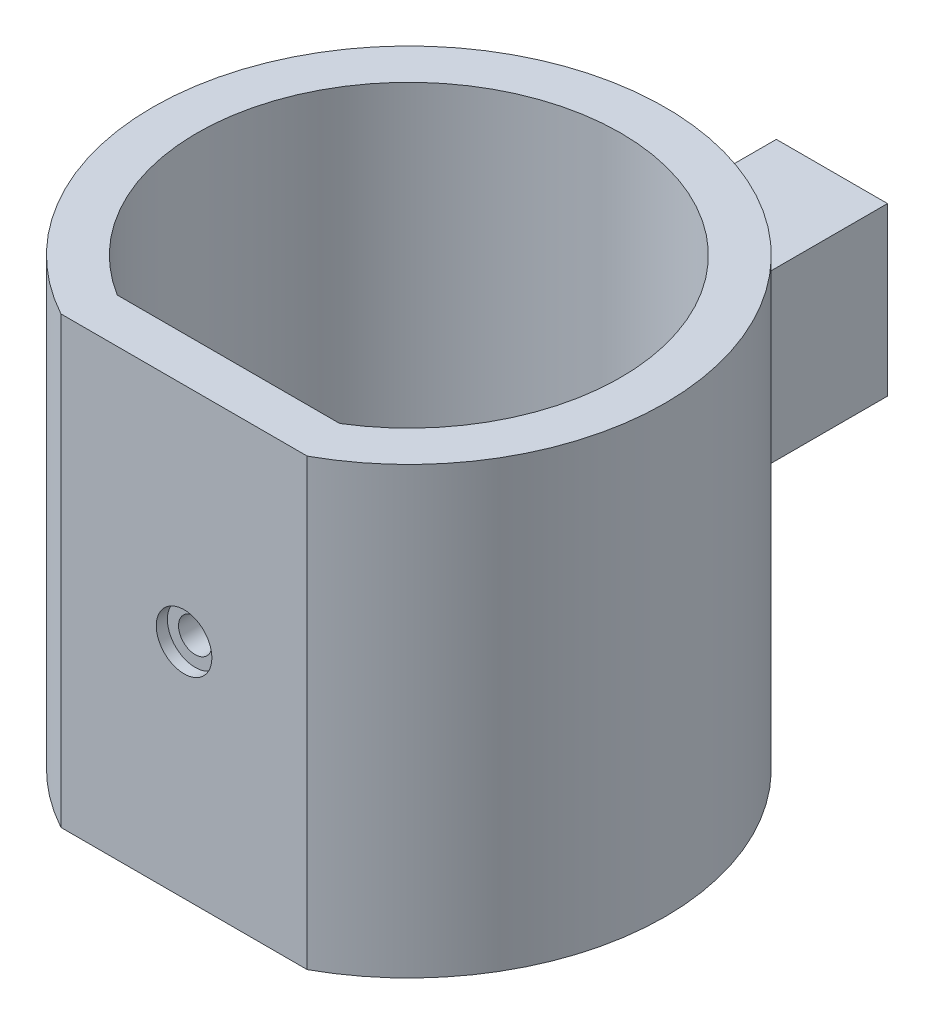
ISO-10303-21;
HEADER;
FILE_DESCRIPTION(('STEP AP214'),'2;1');
FILE_NAME('part.step','',(''),(''),'','','');
FILE_SCHEMA(('AUTOMOTIVE_DESIGN { 1 0 10303 214 1 1 1 1 }'));
ENDSEC;
DATA;
#1=APPLICATION_CONTEXT('core data for automotive mechanical design processes');
#2=APPLICATION_PROTOCOL_DEFINITION('international standard','automotive_design',2000,#1);
#3=PRODUCT_CONTEXT('',#1,'mechanical');
#4=PRODUCT('Part','Part','',(#3));
#5=PRODUCT_RELATED_PRODUCT_CATEGORY('part','',(#4));
#6=PRODUCT_DEFINITION_FORMATION('','',#4);
#7=PRODUCT_DEFINITION_CONTEXT('part definition',#1,'design');
#8=PRODUCT_DEFINITION('design','',#6,#7);
#9=PRODUCT_DEFINITION_SHAPE('','',#8);
#10=(LENGTH_UNIT() NAMED_UNIT(*) SI_UNIT(.MILLI.,.METRE.));
#11=(NAMED_UNIT(*) PLANE_ANGLE_UNIT() SI_UNIT($,.RADIAN.));
#12=(NAMED_UNIT(*) SI_UNIT($,.STERADIAN.) SOLID_ANGLE_UNIT());
#13=UNCERTAINTY_MEASURE_WITH_UNIT(LENGTH_MEASURE(1.E-05),#10,'distance_accuracy_value','');
#14=(GEOMETRIC_REPRESENTATION_CONTEXT(3) GLOBAL_UNCERTAINTY_ASSIGNED_CONTEXT((#13)) GLOBAL_UNIT_ASSIGNED_CONTEXT((#10,
#11,#12)) REPRESENTATION_CONTEXT('',''));
#15=CARTESIAN_POINT('',(0.,0.,0.));
#16=DIRECTION('',(0.,0.,1.));
#17=DIRECTION('',(1.,0.,0.));
#18=AXIS2_PLACEMENT_3D('',#15,#16,#17);
#19=CARTESIAN_POINT('',(0.,0.,-38.05));
#20=DIRECTION('',(0.,0.,-1.));
#21=DIRECTION('',(-1.,0.,0.));
#22=AXIS2_PLACEMENT_3D('',#19,#20,#21);
#23=PLANE('',#22);
#24=DIRECTION('',(0.,1.,0.));
#25=VECTOR('',#24,1.);
#26=CARTESIAN_POINT('',(-5.,-7.5,-38.05));
#27=LINE('',#26,#25);
#28=CARTESIAN_POINT('',(-5.,-7.5,-38.05));
#29=VERTEX_POINT('',#28);
#30=CARTESIAN_POINT('',(-5.,7.5,-38.05));
#31=VERTEX_POINT('',#30);
#32=EDGE_CURVE('E125',#29,#31,#27,.T.);
#33=ORIENTED_EDGE('',*,*,#32,.T.);
#34=DIRECTION('',(1.,0.,0.));
#35=VECTOR('',#34,1.);
#36=CARTESIAN_POINT('',(5.,7.5,-38.05));
#37=LINE('',#36,#35);
#38=CARTESIAN_POINT('',(5.,7.5,-38.05));
#39=VERTEX_POINT('',#38);
#40=EDGE_CURVE('E132',#31,#39,#37,.T.);
#41=ORIENTED_EDGE('',*,*,#40,.T.);
#42=DIRECTION('',(0.,-1.,0.));
#43=VECTOR('',#42,1.);
#44=CARTESIAN_POINT('',(5.,-7.5,-38.05));
#45=LINE('',#44,#43);
#46=CARTESIAN_POINT('',(5.,-7.5,-38.05));
#47=VERTEX_POINT('',#46);
#48=EDGE_CURVE('E131',#39,#47,#45,.T.);
#49=ORIENTED_EDGE('',*,*,#48,.T.);
#50=DIRECTION('',(-1.,0.,0.));
#51=VECTOR('',#50,1.);
#52=CARTESIAN_POINT('',(5.,-7.5,-38.05));
#53=LINE('',#52,#51);
#54=EDGE_CURVE('E116',#47,#29,#53,.T.);
#55=ORIENTED_EDGE('',*,*,#54,.T.);
#56=EDGE_LOOP('',(#33,#41,#49,#55));
#57=FACE_BOUND('',#56,.T.);
#58=ADVANCED_FACE('F37',(#57),#23,.T.);
#59=CARTESIAN_POINT('',(5.,-7.5,-153.05));
#60=DIRECTION('',(-1.,0.,0.));
#61=DIRECTION('',(0.,0.,1.));
#62=AXIS2_PLACEMENT_3D('',#59,#60,#61);
#63=PLANE('',#62);
#64=ORIENTED_EDGE('',*,*,#48,.F.);
#65=DIRECTION('',(0.,0.,1.));
#66=VECTOR('',#65,1.);
#67=CARTESIAN_POINT('',(5.,7.5,-153.05));
#68=LINE('',#67,#66);
#69=CARTESIAN_POINT('',(5.,7.5,-25.5088710059853));
#70=VERTEX_POINT('',#69);
#71=EDGE_CURVE('E140',#39,#70,#68,.T.);
#72=ORIENTED_EDGE('',*,*,#71,.T.);
#73=DIRECTION('',(0.,1.,0.));
#74=VECTOR('',#73,1.);
#75=CARTESIAN_POINT('',(5.,-7.5,-25.5088710059853));
#76=LINE('',#75,#74);
#77=CARTESIAN_POINT('',(5.,-7.5,-25.5088710059853));
#78=VERTEX_POINT('',#77);
#79=EDGE_CURVE('E152',#70,#78,#76,.F.);
#80=ORIENTED_EDGE('',*,*,#79,.T.);
#81=DIRECTION('',(0.,0.,1.));
#82=VECTOR('',#81,1.);
#83=CARTESIAN_POINT('',(5.,-7.5,-153.05));
#84=LINE('',#83,#82);
#85=EDGE_CURVE('E123',#47,#78,#84,.T.);
#86=ORIENTED_EDGE('',*,*,#85,.F.);
#87=EDGE_LOOP('',(#64,#72,#80,#86));
#88=FACE_BOUND('',#87,.T.);
#89=ADVANCED_FACE('F157',(#88),#63,.F.);
#90=CARTESIAN_POINT('',(-5.,-7.5,-153.05));
#91=DIRECTION('',(1.,0.,0.));
#92=DIRECTION('',(0.,0.,-1.));
#93=AXIS2_PLACEMENT_3D('',#90,#91,#92);
#94=PLANE('',#93);
#95=ORIENTED_EDGE('',*,*,#32,.F.);
#96=DIRECTION('',(0.,0.,1.));
#97=VECTOR('',#96,1.);
#98=CARTESIAN_POINT('',(-5.,-7.5,-153.05));
#99=LINE('',#98,#97);
#100=CARTESIAN_POINT('',(-5.,-7.5,-25.5088710059853));
#101=VERTEX_POINT('',#100);
#102=EDGE_CURVE('E41',#29,#101,#99,.T.);
#103=ORIENTED_EDGE('',*,*,#102,.T.);
#104=DIRECTION('',(0.,1.,0.));
#105=VECTOR('',#104,1.);
#106=CARTESIAN_POINT('',(-5.,7.5,-25.5088710059853));
#107=LINE('',#106,#105);
#108=CARTESIAN_POINT('',(-5.,7.5,-25.5088710059853));
#109=VERTEX_POINT('',#108);
#110=EDGE_CURVE('E169',#101,#109,#107,.T.);
#111=ORIENTED_EDGE('',*,*,#110,.T.);
#112=DIRECTION('',(0.,0.,1.));
#113=VECTOR('',#112,1.);
#114=CARTESIAN_POINT('',(-5.,7.5,-153.05));
#115=LINE('',#114,#113);
#116=EDGE_CURVE('E127',#31,#109,#115,.T.);
#117=ORIENTED_EDGE('',*,*,#116,.F.);
#118=EDGE_LOOP('',(#95,#103,#111,#117));
#119=FACE_BOUND('',#118,.T.);
#120=ADVANCED_FACE('F126',(#119),#94,.F.);
#121=CARTESIAN_POINT('',(5.,7.5,-153.05));
#122=DIRECTION('',(0.,-1.,0.));
#123=DIRECTION('',(0.,0.,-1.));
#124=AXIS2_PLACEMENT_3D('',#121,#122,#123);
#125=PLANE('',#124);
#126=ORIENTED_EDGE('',*,*,#40,.F.);
#127=ORIENTED_EDGE('',*,*,#116,.T.);
#128=CARTESIAN_POINT('',(-9.,7.5,-25.5088710059853));
#129=DIRECTION('',(0.,-1.,0.));
#130=DIRECTION('',(0.,0.,-1.));
#131=AXIS2_PLACEMENT_3D('',#128,#129,#130);
#132=CIRCLE('',#131,4.);
#133=CARTESIAN_POINT('',(-7.66913123844732,7.5,-21.736764387725));
#134=VERTEX_POINT('',#133);
#135=EDGE_CURVE('E160',#109,#134,#132,.T.);
#136=ORIENTED_EDGE('',*,*,#135,.T.);
#137=CARTESIAN_POINT('',(0.,7.5,0.));
#138=DIRECTION('',(0.,1.,0.));
#139=DIRECTION('',(0.,0.,1.));
#140=AXIS2_PLACEMENT_3D('',#137,#138,#139);
#141=CIRCLE('',#140,23.05);
#142=CARTESIAN_POINT('',(7.66913123844732,7.5,-21.736764387725));
#143=VERTEX_POINT('',#142);
#144=EDGE_CURVE('E122',#134,#143,#141,.F.);
#145=ORIENTED_EDGE('',*,*,#144,.T.);
#146=CARTESIAN_POINT('',(9.,7.5,-25.5088710059853));
#147=DIRECTION('',(0.,-1.,0.));
#148=DIRECTION('',(0.,0.,-1.));
#149=AXIS2_PLACEMENT_3D('',#146,#147,#148);
#150=CIRCLE('',#149,4.);
#151=EDGE_CURVE('E155',#143,#70,#150,.T.);
#152=ORIENTED_EDGE('',*,*,#151,.T.);
#153=ORIENTED_EDGE('',*,*,#71,.F.);
#154=EDGE_LOOP('',(#126,#127,#136,#145,#152,#153));
#155=FACE_BOUND('',#154,.T.);
#156=ADVANCED_FACE('F39',(#155),#125,.F.);
#157=CARTESIAN_POINT('',(5.,-7.5,-153.05));
#158=DIRECTION('',(0.,1.,0.));
#159=DIRECTION('',(0.,0.,1.));
#160=AXIS2_PLACEMENT_3D('',#157,#158,#159);
#161=PLANE('',#160);
#162=ORIENTED_EDGE('',*,*,#54,.F.);
#163=ORIENTED_EDGE('',*,*,#85,.T.);
#164=CARTESIAN_POINT('',(9.,-7.5,-25.5088710059853));
#165=DIRECTION('',(0.,1.,0.));
#166=DIRECTION('',(0.,0.,1.));
#167=AXIS2_PLACEMENT_3D('',#164,#165,#166);
#168=CIRCLE('',#167,4.);
#169=CARTESIAN_POINT('',(7.66913123844732,-7.5,-21.736764387725));
#170=VERTEX_POINT('',#169);
#171=EDGE_CURVE('E144',#78,#170,#168,.T.);
#172=ORIENTED_EDGE('',*,*,#171,.T.);
#173=CARTESIAN_POINT('',(0.,-7.5,0.));
#174=DIRECTION('',(0.,-1.,0.));
#175=DIRECTION('',(0.,0.,-1.));
#176=AXIS2_PLACEMENT_3D('',#173,#174,#175);
#177=CIRCLE('',#176,23.05);
#178=CARTESIAN_POINT('',(-7.66913123844732,-7.5,-21.736764387725));
#179=VERTEX_POINT('',#178);
#180=EDGE_CURVE('E199',#170,#179,#177,.F.);
#181=ORIENTED_EDGE('',*,*,#180,.T.);
#182=CARTESIAN_POINT('',(-9.,-7.5,-25.5088710059853));
#183=DIRECTION('',(0.,1.,0.));
#184=DIRECTION('',(0.,0.,1.));
#185=AXIS2_PLACEMENT_3D('',#182,#183,#184);
#186=CIRCLE('',#185,4.);
#187=EDGE_CURVE('E118',#179,#101,#186,.T.);
#188=ORIENTED_EDGE('',*,*,#187,.T.);
#189=ORIENTED_EDGE('',*,*,#102,.F.);
#190=EDGE_LOOP('',(#162,#163,#172,#181,#188,#189));
#191=FACE_BOUND('',#190,.T.);
#192=ADVANCED_FACE('F114',(#191),#161,.F.);
#193=CARTESIAN_POINT('',(0.,20.,0.));
#194=DIRECTION('',(0.,-1.,0.));
#195=DIRECTION('',(0.,0.,-1.));
#196=AXIS2_PLACEMENT_3D('',#193,#194,#195);
#197=CYLINDRICAL_SURFACE('',#196,23.05);
#198=CARTESIAN_POINT('',(0.,-20.,0.));
#199=DIRECTION('',(0.,1.,0.));
#200=DIRECTION('',(0.,0.,1.));
#201=AXIS2_PLACEMENT_3D('',#198,#199,#200);
#202=CIRCLE('',#201,23.05);
#203=CARTESIAN_POINT('',(11.076364599346,-20.,20.2142684077944));
#204=VERTEX_POINT('',#203);
#205=CARTESIAN_POINT('',(-11.076364599346,-20.,20.2142684077944));
#206=VERTEX_POINT('',#205);
#207=EDGE_CURVE('E180',#204,#206,#202,.T.);
#208=ORIENTED_EDGE('',*,*,#207,.T.);
#209=DIRECTION('',(0.,-1.,0.));
#210=VECTOR('',#209,1.);
#211=CARTESIAN_POINT('',(-11.076364599346,20.,20.2142684077944));
#212=LINE('',#211,#210);
#213=CARTESIAN_POINT('',(-11.076364599346,20.,20.2142684077944));
#214=VERTEX_POINT('',#213);
#215=EDGE_CURVE('E171',#214,#206,#212,.T.);
#216=ORIENTED_EDGE('',*,*,#215,.F.);
#217=CARTESIAN_POINT('',(0.,20.,0.));
#218=DIRECTION('',(0.,1.,0.));
#219=DIRECTION('',(0.,0.,1.));
#220=AXIS2_PLACEMENT_3D('',#217,#218,#219);
#221=CIRCLE('',#220,23.05);
#222=CARTESIAN_POINT('',(11.076364599346,20.,20.2142684077944));
#223=VERTEX_POINT('',#222);
#224=EDGE_CURVE('E181',#223,#214,#221,.T.);
#225=ORIENTED_EDGE('',*,*,#224,.F.);
#226=DIRECTION('',(0.,-1.,0.));
#227=VECTOR('',#226,1.);
#228=CARTESIAN_POINT('',(11.076364599346,20.,20.2142684077944));
#229=LINE('',#228,#227);
#230=EDGE_CURVE('E174',#223,#204,#229,.T.);
#231=ORIENTED_EDGE('',*,*,#230,.T.);
#232=EDGE_LOOP('',(#208,#216,#225,#231));
#233=FACE_BOUND('',#232,.T.);
#234=ORIENTED_EDGE('',*,*,#144,.F.);
#235=DIRECTION('',(0.,-1.,0.));
#236=VECTOR('',#235,1.);
#237=CARTESIAN_POINT('',(-7.66913123844732,20.,-21.736764387725));
#238=LINE('',#237,#236);
#239=EDGE_CURVE('E159',#134,#179,#238,.T.);
#240=ORIENTED_EDGE('',*,*,#239,.T.);
#241=ORIENTED_EDGE('',*,*,#180,.F.);
#242=DIRECTION('',(0.,-1.,0.));
#243=VECTOR('',#242,1.);
#244=CARTESIAN_POINT('',(7.66913123844732,20.,-21.736764387725));
#245=LINE('',#244,#243);
#246=EDGE_CURVE('E154',#170,#143,#245,.F.);
#247=ORIENTED_EDGE('',*,*,#246,.T.);
#248=EDGE_LOOP('',(#234,#240,#241,#247));
#249=FACE_BOUND('',#248,.T.);
#250=ADVANCED_FACE('F238',(#233,#249),#197,.T.);
#251=CARTESIAN_POINT('',(0.,20.,0.));
#252=DIRECTION('',(0.,1.,0.));
#253=DIRECTION('',(0.,0.,1.));
#254=AXIS2_PLACEMENT_3D('',#251,#252,#253);
#255=PLANE('',#254);
#256=ORIENTED_EDGE('',*,*,#224,.T.);
#257=DIRECTION('',(1.,0.,0.));
#258=VECTOR('',#257,1.);
#259=CARTESIAN_POINT('',(-11.076364599346,20.,20.2142684077944));
#260=LINE('',#259,#258);
#261=EDGE_CURVE('E177',#214,#223,#260,.T.);
#262=ORIENTED_EDGE('',*,*,#261,.T.);
#263=EDGE_LOOP('',(#256,#262));
#264=FACE_BOUND('',#263,.T.);
#265=DIRECTION('',(1.,0.,0.));
#266=VECTOR('',#265,1.);
#267=CARTESIAN_POINT('',(-10.,20.,16.2142684077944));
#268=LINE('',#267,#266);
#269=CARTESIAN_POINT('',(-10.,20.,16.2142684077944));
#270=VERTEX_POINT('',#269);
#271=CARTESIAN_POINT('',(10.,20.,16.2142684077944));
#272=VERTEX_POINT('',#271);
#273=EDGE_CURVE('E191',#270,#272,#268,.T.);
#274=ORIENTED_EDGE('',*,*,#273,.F.);
#275=CARTESIAN_POINT('',(0.,20.,0.));
#276=DIRECTION('',(0.,1.,0.));
#277=DIRECTION('',(0.,0.,1.));
#278=AXIS2_PLACEMENT_3D('',#275,#276,#277);
#279=CIRCLE('',#278,19.05);
#280=EDGE_CURVE('E193',#272,#270,#279,.T.);
#281=ORIENTED_EDGE('',*,*,#280,.F.);
#282=EDGE_LOOP('',(#274,#281));
#283=FACE_BOUND('',#282,.T.);
#284=ADVANCED_FACE('F244',(#264,#283),#255,.T.);
#285=CARTESIAN_POINT('',(0.,-20.,0.));
#286=DIRECTION('',(0.,1.,0.));
#287=DIRECTION('',(0.,0.,1.));
#288=AXIS2_PLACEMENT_3D('',#285,#286,#287);
#289=PLANE('',#288);
#290=ORIENTED_EDGE('',*,*,#207,.F.);
#291=DIRECTION('',(1.,0.,0.));
#292=VECTOR('',#291,1.);
#293=CARTESIAN_POINT('',(-11.076364599346,-20.,20.2142684077944));
#294=LINE('',#293,#292);
#295=EDGE_CURVE('E178',#206,#204,#294,.T.);
#296=ORIENTED_EDGE('',*,*,#295,.F.);
#297=EDGE_LOOP('',(#290,#296));
#298=FACE_BOUND('',#297,.T.);
#299=CARTESIAN_POINT('',(0.,-20.,0.));
#300=DIRECTION('',(0.,1.,0.));
#301=DIRECTION('',(0.,0.,1.));
#302=AXIS2_PLACEMENT_3D('',#299,#300,#301);
#303=CIRCLE('',#302,19.05);
#304=CARTESIAN_POINT('',(10.,-20.,16.2142684077944));
#305=VERTEX_POINT('',#304);
#306=CARTESIAN_POINT('',(-10.,-20.,16.2142684077944));
#307=VERTEX_POINT('',#306);
#308=EDGE_CURVE('E141',#305,#307,#303,.T.);
#309=ORIENTED_EDGE('',*,*,#308,.T.);
#310=DIRECTION('',(1.,0.,0.));
#311=VECTOR('',#310,1.);
#312=CARTESIAN_POINT('',(-10.,-20.,16.2142684077944));
#313=LINE('',#312,#311);
#314=EDGE_CURVE('E54',#307,#305,#313,.T.);
#315=ORIENTED_EDGE('',*,*,#314,.T.);
#316=EDGE_LOOP('',(#309,#315));
#317=FACE_BOUND('',#316,.T.);
#318=ADVANCED_FACE('F268',(#298,#317),#289,.F.);
#319=CARTESIAN_POINT('',(-11.076364599346,20.,20.2142684077944));
#320=DIRECTION('',(0.,0.,-1.));
#321=DIRECTION('',(-1.,0.,0.));
#322=AXIS2_PLACEMENT_3D('',#319,#320,#321);
#323=PLANE('',#322);
#324=CARTESIAN_POINT('',(0.,0.,20.2142684077944));
#325=DIRECTION('',(0.,0.,1.));
#326=DIRECTION('',(1.,0.,0.));
#327=AXIS2_PLACEMENT_3D('',#324,#325,#326);
#328=CIRCLE('',#327,2.5);
#329=CARTESIAN_POINT('',(2.5,0.,20.2142684077944));
#330=VERTEX_POINT('',#329);
#331=EDGE_CURVE('E11',#330,#330,#328,.T.);
#332=ORIENTED_EDGE('',*,*,#331,.F.);
#333=EDGE_LOOP('',(#332));
#334=FACE_BOUND('',#333,.T.);
#335=ORIENTED_EDGE('',*,*,#295,.T.);
#336=ORIENTED_EDGE('',*,*,#230,.F.);
#337=ORIENTED_EDGE('',*,*,#261,.F.);
#338=ORIENTED_EDGE('',*,*,#215,.T.);
#339=EDGE_LOOP('',(#335,#336,#337,#338));
#340=FACE_BOUND('',#339,.T.);
#341=ADVANCED_FACE('F265',(#334,#340),#323,.F.);
#342=CARTESIAN_POINT('',(0.,20.,0.));
#343=DIRECTION('',(0.,-1.,0.));
#344=DIRECTION('',(0.,0.,-1.));
#345=AXIS2_PLACEMENT_3D('',#342,#343,#344);
#346=CYLINDRICAL_SURFACE('',#345,19.05);
#347=ORIENTED_EDGE('',*,*,#308,.F.);
#348=DIRECTION('',(0.,-1.,0.));
#349=VECTOR('',#348,1.);
#350=CARTESIAN_POINT('',(10.,20.,16.2142684077944));
#351=LINE('',#350,#349);
#352=EDGE_CURVE('E189',#272,#305,#351,.T.);
#353=ORIENTED_EDGE('',*,*,#352,.F.);
#354=ORIENTED_EDGE('',*,*,#280,.T.);
#355=DIRECTION('',(0.,-1.,0.));
#356=VECTOR('',#355,1.);
#357=CARTESIAN_POINT('',(-10.,20.,16.2142684077944));
#358=LINE('',#357,#356);
#359=EDGE_CURVE('E184',#270,#307,#358,.T.);
#360=ORIENTED_EDGE('',*,*,#359,.T.);
#361=EDGE_LOOP('',(#347,#353,#354,#360));
#362=FACE_BOUND('',#361,.T.);
#363=ADVANCED_FACE('F261',(#362),#346,.F.);
#364=CARTESIAN_POINT('',(-10.,20.,16.2142684077944));
#365=DIRECTION('',(0.,0.,-1.));
#366=DIRECTION('',(-1.,0.,0.));
#367=AXIS2_PLACEMENT_3D('',#364,#365,#366);
#368=PLANE('',#367);
#369=CARTESIAN_POINT('',(0.,0.,16.2142684077944));
#370=DIRECTION('',(0.,0.,-1.));
#371=DIRECTION('',(-1.,0.,0.));
#372=AXIS2_PLACEMENT_3D('',#369,#370,#371);
#373=CIRCLE('',#372,1.5);
#374=CARTESIAN_POINT('',(-1.5,0.,16.2142684077944));
#375=VERTEX_POINT('',#374);
#376=EDGE_CURVE('E201',#375,#375,#373,.F.);
#377=ORIENTED_EDGE('',*,*,#376,.T.);
#378=EDGE_LOOP('',(#377));
#379=FACE_BOUND('',#378,.T.);
#380=ORIENTED_EDGE('',*,*,#314,.F.);
#381=ORIENTED_EDGE('',*,*,#359,.F.);
#382=ORIENTED_EDGE('',*,*,#273,.T.);
#383=ORIENTED_EDGE('',*,*,#352,.T.);
#384=EDGE_LOOP('',(#380,#381,#382,#383));
#385=FACE_BOUND('',#384,.T.);
#386=ADVANCED_FACE('F254',(#379,#385),#368,.T.);
#387=CARTESIAN_POINT('',(-9.,20.,-25.5088710059853));
#388=DIRECTION('',(0.,-1.,0.));
#389=DIRECTION('',(0.,0.,-1.));
#390=AXIS2_PLACEMENT_3D('',#387,#388,#389);
#391=CYLINDRICAL_SURFACE('',#390,4.);
#392=ORIENTED_EDGE('',*,*,#187,.F.);
#393=ORIENTED_EDGE('',*,*,#239,.F.);
#394=ORIENTED_EDGE('',*,*,#135,.F.);
#395=ORIENTED_EDGE('',*,*,#110,.F.);
#396=EDGE_LOOP('',(#392,#393,#394,#395));
#397=FACE_BOUND('',#396,.T.);
#398=ADVANCED_FACE('F252',(#397),#391,.F.);
#399=CARTESIAN_POINT('',(9.,20.,-25.5088710059853));
#400=DIRECTION('',(0.,-1.,0.));
#401=DIRECTION('',(0.,0.,-1.));
#402=AXIS2_PLACEMENT_3D('',#399,#400,#401);
#403=CYLINDRICAL_SURFACE('',#402,4.);
#404=ORIENTED_EDGE('',*,*,#151,.F.);
#405=ORIENTED_EDGE('',*,*,#246,.F.);
#406=ORIENTED_EDGE('',*,*,#171,.F.);
#407=ORIENTED_EDGE('',*,*,#79,.F.);
#408=EDGE_LOOP('',(#404,#405,#406,#407));
#409=FACE_BOUND('',#408,.T.);
#410=ADVANCED_FACE('F151',(#409),#403,.F.);
#411=CARTESIAN_POINT('',(0.,0.,11.9716277206751));
#412=DIRECTION('',(0.,0.,1.));
#413=DIRECTION('',(1.,0.,0.));
#414=AXIS2_PLACEMENT_3D('',#411,#412,#413);
#415=CYLINDRICAL_SURFACE('',#414,1.5);
#416=CARTESIAN_POINT('',(0.,0.,19.2142684077944));
#417=DIRECTION('',(0.,0.,-1.));
#418=DIRECTION('',(-1.,0.,0.));
#419=AXIS2_PLACEMENT_3D('',#416,#417,#418);
#420=CIRCLE('',#419,1.5);
#421=CARTESIAN_POINT('',(-1.5,0.,19.2142684077944));
#422=VERTEX_POINT('',#421);
#423=EDGE_CURVE('E205',#422,#422,#420,.F.);
#424=ORIENTED_EDGE('',*,*,#423,.T.);
#425=EDGE_LOOP('',(#424));
#426=FACE_BOUND('',#425,.T.);
#427=ORIENTED_EDGE('',*,*,#376,.F.);
#428=EDGE_LOOP('',(#427));
#429=FACE_BOUND('',#428,.T.);
#430=ADVANCED_FACE('F214',(#426,#429),#415,.F.);
#431=CARTESIAN_POINT('',(-10.,20.,19.2142684077944));
#432=DIRECTION('',(0.,0.,-1.));
#433=DIRECTION('',(-1.,0.,0.));
#434=AXIS2_PLACEMENT_3D('',#431,#432,#433);
#435=PLANE('',#434);
#436=CARTESIAN_POINT('',(0.,0.,19.2142684077944));
#437=DIRECTION('',(0.,0.,-1.));
#438=DIRECTION('',(-1.,0.,0.));
#439=AXIS2_PLACEMENT_3D('',#436,#437,#438);
#440=CIRCLE('',#439,2.5);
#441=CARTESIAN_POINT('',(-2.5,0.,19.2142684077944));
#442=VERTEX_POINT('',#441);
#443=EDGE_CURVE('E47',#442,#442,#440,.F.);
#444=ORIENTED_EDGE('',*,*,#443,.T.);
#445=EDGE_LOOP('',(#444));
#446=FACE_BOUND('',#445,.T.);
#447=ORIENTED_EDGE('',*,*,#423,.F.);
#448=EDGE_LOOP('',(#447));
#449=FACE_BOUND('',#448,.T.);
#450=ADVANCED_FACE('F217',(#446,#449),#435,.F.);
#451=CARTESIAN_POINT('',(0.,0.,9.14320059592893));
#452=DIRECTION('',(0.,0.,1.));
#453=DIRECTION('',(1.,0.,0.));
#454=AXIS2_PLACEMENT_3D('',#451,#452,#453);
#455=CYLINDRICAL_SURFACE('',#454,2.5);
#456=ORIENTED_EDGE('',*,*,#331,.T.);
#457=EDGE_LOOP('',(#456));
#458=FACE_BOUND('',#457,.T.);
#459=ORIENTED_EDGE('',*,*,#443,.F.);
#460=EDGE_LOOP('',(#459));
#461=FACE_BOUND('',#460,.T.);
#462=ADVANCED_FACE('F219',(#458,#461),#455,.F.);
#463=CLOSED_SHELL('',(#58,#89,#120,#156,#192,#250,#284,#318,#341,#363,#386,#398,#410,#430,#450,#462));
#464=MANIFOLD_SOLID_BREP('B2',#463);
#465=ADVANCED_BREP_SHAPE_REPRESENTATION('',(#18,#464),#14);
#466=SHAPE_DEFINITION_REPRESENTATION(#9,#465);
ENDSEC;
END-ISO-10303-21;
